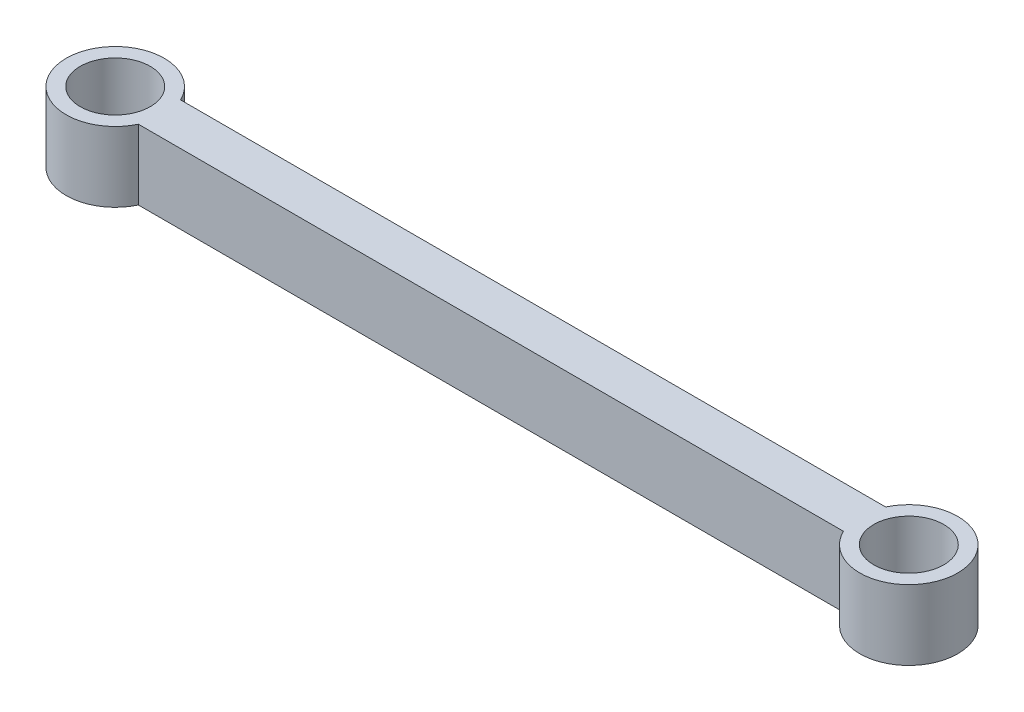
ISO-10303-21;
HEADER;
FILE_DESCRIPTION(('STEP AP214'),'2;1');
FILE_NAME('part.step','',(''),(''),'','','');
FILE_SCHEMA(('AUTOMOTIVE_DESIGN { 1 0 10303 214 1 1 1 1 }'));
ENDSEC;
DATA;
#1=APPLICATION_CONTEXT('core data for automotive mechanical design processes');
#2=APPLICATION_PROTOCOL_DEFINITION('international standard','automotive_design',2000,#1);
#3=PRODUCT_CONTEXT('',#1,'mechanical');
#4=PRODUCT('Part','Part','',(#3));
#5=PRODUCT_RELATED_PRODUCT_CATEGORY('part','',(#4));
#6=PRODUCT_DEFINITION_FORMATION('','',#4);
#7=PRODUCT_DEFINITION_CONTEXT('part definition',#1,'design');
#8=PRODUCT_DEFINITION('design','',#6,#7);
#9=PRODUCT_DEFINITION_SHAPE('','',#8);
#10=(LENGTH_UNIT() NAMED_UNIT(*) SI_UNIT(.MILLI.,.METRE.));
#11=(NAMED_UNIT(*) PLANE_ANGLE_UNIT() SI_UNIT($,.RADIAN.));
#12=(NAMED_UNIT(*) SI_UNIT($,.STERADIAN.) SOLID_ANGLE_UNIT());
#13=UNCERTAINTY_MEASURE_WITH_UNIT(LENGTH_MEASURE(1.E-05),#10,'distance_accuracy_value','');
#14=(GEOMETRIC_REPRESENTATION_CONTEXT(3) GLOBAL_UNCERTAINTY_ASSIGNED_CONTEXT((#13)) GLOBAL_UNIT_ASSIGNED_CONTEXT((#10,
#11,#12)) REPRESENTATION_CONTEXT('',''));
#15=CARTESIAN_POINT('',(0.,0.,0.));
#16=DIRECTION('',(0.,0.,1.));
#17=DIRECTION('',(1.,0.,0.));
#18=AXIS2_PLACEMENT_3D('',#15,#16,#17);
#19=CARTESIAN_POINT('',(0.,100.,30.095541494428));
#20=DIRECTION('',(0.,0.,-1.));
#21=DIRECTION('',(-1.,0.,0.));
#22=AXIS2_PLACEMENT_3D('',#19,#20,#21);
#23=PLANE('',#22);
#24=DIRECTION('',(1.,0.,0.));
#25=VECTOR('',#24,1.);
#26=CARTESIAN_POINT('',(0.,0.,30.095541494428));
#27=LINE('',#26,#25);
#28=CARTESIAN_POINT('',(63.2001454282913,0.,30.095541494428));
#29=VERTEX_POINT('',#28);
#30=CARTESIAN_POINT('',(1070.30692661484,0.,30.0955414944279));
#31=VERTEX_POINT('',#30);
#32=EDGE_CURVE('E97',#29,#31,#27,.T.);
#33=ORIENTED_EDGE('',*,*,#32,.T.);
#34=DIRECTION('',(0.,-1.,0.));
#35=VECTOR('',#34,1.);
#36=CARTESIAN_POINT('',(1070.30692661484,100.,30.0955414944279));
#37=LINE('',#36,#35);
#38=CARTESIAN_POINT('',(1070.30692661484,100.,30.0955414944279));
#39=VERTEX_POINT('',#38);
#40=EDGE_CURVE('E11',#39,#31,#37,.T.);
#41=ORIENTED_EDGE('',*,*,#40,.F.);
#42=DIRECTION('',(1.,0.,0.));
#43=VECTOR('',#42,1.);
#44=CARTESIAN_POINT('',(0.,100.,30.095541494428));
#45=LINE('',#44,#43);
#46=CARTESIAN_POINT('',(63.2001454282913,100.,30.095541494428));
#47=VERTEX_POINT('',#46);
#48=EDGE_CURVE('E82',#47,#39,#45,.T.);
#49=ORIENTED_EDGE('',*,*,#48,.F.);
#50=DIRECTION('',(0.,-1.,0.));
#51=VECTOR('',#50,1.);
#52=CARTESIAN_POINT('',(63.2001454282913,100.,30.095541494428));
#53=LINE('',#52,#51);
#54=EDGE_CURVE('E93',#47,#29,#53,.T.);
#55=ORIENTED_EDGE('',*,*,#54,.T.);
#56=EDGE_LOOP('',(#33,#41,#49,#55));
#57=FACE_BOUND('',#56,.T.);
#58=ADVANCED_FACE('F35',(#57),#23,.F.);
#59=CARTESIAN_POINT('',(1133.50707204313,100.,4.54146978179198E-13));
#60=DIRECTION('',(0.,-1.,0.));
#61=DIRECTION('',(0.,0.,-1.));
#62=AXIS2_PLACEMENT_3D('',#59,#60,#61);
#63=CYLINDRICAL_SURFACE('',#62,70.);
#64=CARTESIAN_POINT('',(1133.50707204313,0.,4.54146978179198E-13));
#65=DIRECTION('',(0.,1.,0.));
#66=DIRECTION('',(0.,0.,1.));
#67=AXIS2_PLACEMENT_3D('',#64,#65,#66);
#68=CIRCLE('',#67,70.);
#69=CARTESIAN_POINT('',(1070.30692661484,0.,-30.095541494428));
#70=VERTEX_POINT('',#69);
#71=EDGE_CURVE('E87',#31,#70,#68,.T.);
#72=ORIENTED_EDGE('',*,*,#71,.T.);
#73=DIRECTION('',(0.,-1.,0.));
#74=VECTOR('',#73,1.);
#75=CARTESIAN_POINT('',(1070.30692661484,100.,-30.095541494428));
#76=LINE('',#75,#74);
#77=CARTESIAN_POINT('',(1070.30692661484,100.,-30.095541494428));
#78=VERTEX_POINT('',#77);
#79=EDGE_CURVE('E43',#78,#70,#76,.T.);
#80=ORIENTED_EDGE('',*,*,#79,.F.);
#81=CARTESIAN_POINT('',(1133.50707204313,100.,4.54146978179198E-13));
#82=DIRECTION('',(0.,1.,0.));
#83=DIRECTION('',(0.,0.,1.));
#84=AXIS2_PLACEMENT_3D('',#81,#82,#83);
#85=CIRCLE('',#84,70.);
#86=EDGE_CURVE('E77',#39,#78,#85,.T.);
#87=ORIENTED_EDGE('',*,*,#86,.F.);
#88=ORIENTED_EDGE('',*,*,#40,.T.);
#89=EDGE_LOOP('',(#72,#80,#87,#88));
#90=FACE_BOUND('',#89,.T.);
#91=ADVANCED_FACE('F86',(#90),#63,.T.);
#92=CARTESIAN_POINT('',(0.,100.,-30.095541494428));
#93=DIRECTION('',(0.,0.,-1.));
#94=DIRECTION('',(-1.,0.,0.));
#95=AXIS2_PLACEMENT_3D('',#92,#93,#94);
#96=PLANE('',#95);
#97=DIRECTION('',(1.,0.,0.));
#98=VECTOR('',#97,1.);
#99=CARTESIAN_POINT('',(0.,0.,-30.095541494428));
#100=LINE('',#99,#98);
#101=CARTESIAN_POINT('',(63.2001454282913,0.,-30.095541494428));
#102=VERTEX_POINT('',#101);
#103=EDGE_CURVE('E102',#102,#70,#100,.T.);
#104=ORIENTED_EDGE('',*,*,#103,.F.);
#105=DIRECTION('',(0.,-1.,0.));
#106=VECTOR('',#105,1.);
#107=CARTESIAN_POINT('',(63.2001454282913,100.,-30.095541494428));
#108=LINE('',#107,#106);
#109=CARTESIAN_POINT('',(63.2001454282913,100.,-30.095541494428));
#110=VERTEX_POINT('',#109);
#111=EDGE_CURVE('E67',#110,#102,#108,.T.);
#112=ORIENTED_EDGE('',*,*,#111,.F.);
#113=DIRECTION('',(1.,0.,0.));
#114=VECTOR('',#113,1.);
#115=CARTESIAN_POINT('',(0.,100.,-30.095541494428));
#116=LINE('',#115,#114);
#117=EDGE_CURVE('E80',#110,#78,#116,.T.);
#118=ORIENTED_EDGE('',*,*,#117,.T.);
#119=ORIENTED_EDGE('',*,*,#79,.T.);
#120=EDGE_LOOP('',(#104,#112,#118,#119));
#121=FACE_BOUND('',#120,.T.);
#122=ADVANCED_FACE('F91',(#121),#96,.T.);
#123=CARTESIAN_POINT('',(0.,100.,0.));
#124=DIRECTION('',(0.,-1.,0.));
#125=DIRECTION('',(0.,0.,-1.));
#126=AXIS2_PLACEMENT_3D('',#123,#124,#125);
#127=CYLINDRICAL_SURFACE('',#126,70.);
#128=CARTESIAN_POINT('',(0.,0.,0.));
#129=DIRECTION('',(0.,1.,0.));
#130=DIRECTION('',(0.,0.,1.));
#131=AXIS2_PLACEMENT_3D('',#128,#129,#130);
#132=CIRCLE('',#131,70.);
#133=EDGE_CURVE('E70',#102,#29,#132,.T.);
#134=ORIENTED_EDGE('',*,*,#133,.T.);
#135=ORIENTED_EDGE('',*,*,#54,.F.);
#136=CARTESIAN_POINT('',(0.,100.,0.));
#137=DIRECTION('',(0.,1.,0.));
#138=DIRECTION('',(0.,0.,1.));
#139=AXIS2_PLACEMENT_3D('',#136,#137,#138);
#140=CIRCLE('',#139,70.);
#141=EDGE_CURVE('E51',#110,#47,#140,.T.);
#142=ORIENTED_EDGE('',*,*,#141,.F.);
#143=ORIENTED_EDGE('',*,*,#111,.T.);
#144=EDGE_LOOP('',(#134,#135,#142,#143));
#145=FACE_BOUND('',#144,.T.);
#146=ADVANCED_FACE('F121',(#145),#127,.T.);
#147=CARTESIAN_POINT('',(0.,100.,0.));
#148=DIRECTION('',(0.,1.,0.));
#149=DIRECTION('',(0.,0.,1.));
#150=AXIS2_PLACEMENT_3D('',#147,#148,#149);
#151=PLANE('',#150);
#152=CARTESIAN_POINT('',(1133.50707204313,100.,4.54146978179198E-13));
#153=DIRECTION('',(0.,1.,0.));
#154=DIRECTION('',(0.,0.,1.));
#155=AXIS2_PLACEMENT_3D('',#152,#153,#154);
#156=CIRCLE('',#155,50.);
#157=CARTESIAN_POINT('',(1133.50707204313,100.,50.0000000000005));
#158=VERTEX_POINT('',#157);
#159=EDGE_CURVE('E187',#158,#158,#156,.T.);
#160=ORIENTED_EDGE('',*,*,#159,.F.);
#161=EDGE_LOOP('',(#160));
#162=FACE_BOUND('',#161,.T.);
#163=CARTESIAN_POINT('',(0.,100.,0.));
#164=DIRECTION('',(0.,1.,0.));
#165=DIRECTION('',(0.,0.,1.));
#166=AXIS2_PLACEMENT_3D('',#163,#164,#165);
#167=CIRCLE('',#166,50.);
#168=CARTESIAN_POINT('',(0.,100.,50.));
#169=VERTEX_POINT('',#168);
#170=EDGE_CURVE('E181',#169,#169,#167,.T.);
#171=ORIENTED_EDGE('',*,*,#170,.F.);
#172=EDGE_LOOP('',(#171));
#173=FACE_BOUND('',#172,.T.);
#174=ORIENTED_EDGE('',*,*,#48,.T.);
#175=ORIENTED_EDGE('',*,*,#86,.T.);
#176=ORIENTED_EDGE('',*,*,#117,.F.);
#177=ORIENTED_EDGE('',*,*,#141,.T.);
#178=EDGE_LOOP('',(#174,#175,#176,#177));
#179=FACE_BOUND('',#178,.T.);
#180=ADVANCED_FACE('F78',(#162,#173,#179),#151,.T.);
#181=CARTESIAN_POINT('',(0.,0.,0.));
#182=DIRECTION('',(0.,1.,0.));
#183=DIRECTION('',(0.,0.,1.));
#184=AXIS2_PLACEMENT_3D('',#181,#182,#183);
#185=PLANE('',#184);
#186=CARTESIAN_POINT('',(1133.50707204313,0.,4.54146978179198E-13));
#187=DIRECTION('',(0.,1.,0.));
#188=DIRECTION('',(0.,0.,1.));
#189=AXIS2_PLACEMENT_3D('',#186,#187,#188);
#190=CIRCLE('',#189,50.);
#191=CARTESIAN_POINT('',(1133.50707204313,0.,50.0000000000005));
#192=VERTEX_POINT('',#191);
#193=EDGE_CURVE('E184',#192,#192,#190,.T.);
#194=ORIENTED_EDGE('',*,*,#193,.T.);
#195=EDGE_LOOP('',(#194));
#196=FACE_BOUND('',#195,.T.);
#197=ORIENTED_EDGE('',*,*,#32,.F.);
#198=ORIENTED_EDGE('',*,*,#133,.F.);
#199=ORIENTED_EDGE('',*,*,#103,.T.);
#200=ORIENTED_EDGE('',*,*,#71,.F.);
#201=EDGE_LOOP('',(#197,#198,#199,#200));
#202=FACE_BOUND('',#201,.T.);
#203=ADVANCED_FACE('F109',(#196,#202),#185,.F.);
#204=CARTESIAN_POINT('',(0.,5.,0.));
#205=DIRECTION('',(0.,1.,0.));
#206=DIRECTION('',(0.,0.,1.));
#207=AXIS2_PLACEMENT_3D('',#204,#205,#206);
#208=CYLINDRICAL_SURFACE('',#207,50.);
#209=CARTESIAN_POINT('',(0.,5.,0.));
#210=DIRECTION('',(0.,1.,0.));
#211=DIRECTION('',(0.,0.,1.));
#212=AXIS2_PLACEMENT_3D('',#209,#210,#211);
#213=CIRCLE('',#212,50.);
#214=CARTESIAN_POINT('',(0.,5.,50.));
#215=VERTEX_POINT('',#214);
#216=EDGE_CURVE('E100',#215,#215,#213,.T.);
#217=ORIENTED_EDGE('',*,*,#216,.F.);
#218=EDGE_LOOP('',(#217));
#219=FACE_BOUND('',#218,.T.);
#220=ORIENTED_EDGE('',*,*,#170,.T.);
#221=EDGE_LOOP('',(#220));
#222=FACE_BOUND('',#221,.T.);
#223=ADVANCED_FACE('F111',(#219,#222),#208,.F.);
#224=CARTESIAN_POINT('',(0.,5.,0.));
#225=DIRECTION('',(0.,1.,0.));
#226=DIRECTION('',(0.,0.,1.));
#227=AXIS2_PLACEMENT_3D('',#224,#225,#226);
#228=PLANE('',#227);
#229=ORIENTED_EDGE('',*,*,#216,.T.);
#230=EDGE_LOOP('',(#229));
#231=FACE_BOUND('',#230,.T.);
#232=ADVANCED_FACE('F118',(#231),#228,.T.);
#233=CARTESIAN_POINT('',(1133.50707204313,0.,4.54146978179198E-13));
#234=DIRECTION('',(0.,1.,0.));
#235=DIRECTION('',(0.,0.,1.));
#236=AXIS2_PLACEMENT_3D('',#233,#234,#235);
#237=CYLINDRICAL_SURFACE('',#236,50.);
#238=ORIENTED_EDGE('',*,*,#193,.F.);
#239=EDGE_LOOP('',(#238));
#240=FACE_BOUND('',#239,.T.);
#241=ORIENTED_EDGE('',*,*,#159,.T.);
#242=EDGE_LOOP('',(#241));
#243=FACE_BOUND('',#242,.T.);
#244=ADVANCED_FACE('F161',(#240,#243),#237,.F.);
#245=CLOSED_SHELL('',(#58,#91,#122,#146,#180,#203,#223,#232,#244));
#246=MANIFOLD_SOLID_BREP('B2',#245);
#247=ADVANCED_BREP_SHAPE_REPRESENTATION('',(#18,#246),#14);
#248=SHAPE_DEFINITION_REPRESENTATION(#9,#247);
ENDSEC;
END-ISO-10303-21;
